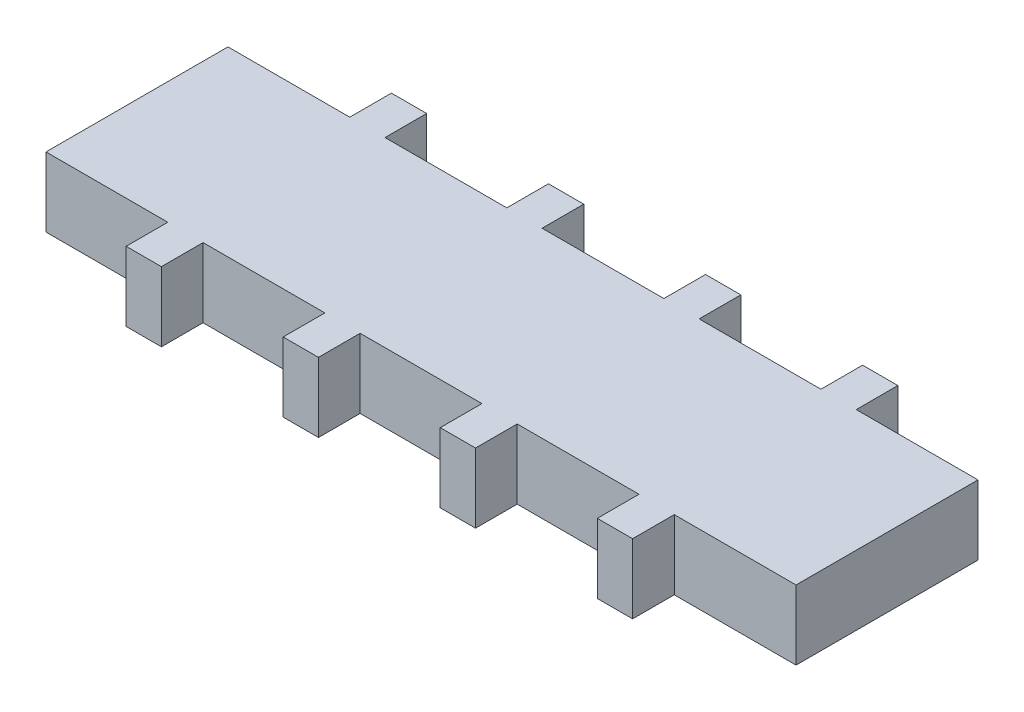
ISO-10303-21;
HEADER;
FILE_DESCRIPTION(('STEP AP214'),'2;1');
FILE_NAME('part.step','',(''),(''),'','','');
FILE_SCHEMA(('AUTOMOTIVE_DESIGN { 1 0 10303 214 1 1 1 1 }'));
ENDSEC;
DATA;
#1=APPLICATION_CONTEXT('core data for automotive mechanical design processes');
#2=APPLICATION_PROTOCOL_DEFINITION('international standard','automotive_design',2000,#1);
#3=PRODUCT_CONTEXT('',#1,'mechanical');
#4=PRODUCT('Part','Part','',(#3));
#5=PRODUCT_RELATED_PRODUCT_CATEGORY('part','',(#4));
#6=PRODUCT_DEFINITION_FORMATION('','',#4);
#7=PRODUCT_DEFINITION_CONTEXT('part definition',#1,'design');
#8=PRODUCT_DEFINITION('design','',#6,#7);
#9=PRODUCT_DEFINITION_SHAPE('','',#8);
#10=(LENGTH_UNIT() NAMED_UNIT(*) SI_UNIT(.MILLI.,.METRE.));
#11=(NAMED_UNIT(*) PLANE_ANGLE_UNIT() SI_UNIT($,.RADIAN.));
#12=(NAMED_UNIT(*) SI_UNIT($,.STERADIAN.) SOLID_ANGLE_UNIT());
#13=UNCERTAINTY_MEASURE_WITH_UNIT(LENGTH_MEASURE(1.E-05),#10,'distance_accuracy_value','');
#14=(GEOMETRIC_REPRESENTATION_CONTEXT(3) GLOBAL_UNCERTAINTY_ASSIGNED_CONTEXT((#13)) GLOBAL_UNIT_ASSIGNED_CONTEXT((#10,
#11,#12)) REPRESENTATION_CONTEXT('',''));
#15=CARTESIAN_POINT('',(0.,0.,0.));
#16=DIRECTION('',(0.,0.,1.));
#17=DIRECTION('',(1.,0.,0.));
#18=AXIS2_PLACEMENT_3D('',#15,#16,#17);
#19=CARTESIAN_POINT('',(27.,5.,0.));
#20=DIRECTION('',(1.,0.,0.));
#21=DIRECTION('',(0.,0.,-1.));
#22=AXIS2_PLACEMENT_3D('',#19,#20,#21);
#23=PLANE('',#22);
#24=DIRECTION('',(0.,0.,1.));
#25=VECTOR('',#24,1.);
#26=CARTESIAN_POINT('',(27.,0.,0.));
#27=LINE('',#26,#25);
#28=CARTESIAN_POINT('',(27.,0.,-6.55));
#29=VERTEX_POINT('',#28);
#30=CARTESIAN_POINT('',(27.,0.,6.55));
#31=VERTEX_POINT('',#30);
#32=EDGE_CURVE('E302',#29,#31,#27,.T.);
#33=ORIENTED_EDGE('',*,*,#32,.F.);
#34=DIRECTION('',(0.,-1.,0.));
#35=VECTOR('',#34,1.);
#36=CARTESIAN_POINT('',(27.,5.,-6.55));
#37=LINE('',#36,#35);
#38=CARTESIAN_POINT('',(27.,5.,-6.55));
#39=VERTEX_POINT('',#38);
#40=EDGE_CURVE('E11',#39,#29,#37,.T.);
#41=ORIENTED_EDGE('',*,*,#40,.F.);
#42=DIRECTION('',(0.,0.,1.));
#43=VECTOR('',#42,1.);
#44=CARTESIAN_POINT('',(27.,5.,0.));
#45=LINE('',#44,#43);
#46=CARTESIAN_POINT('',(27.,5.,6.55));
#47=VERTEX_POINT('',#46);
#48=EDGE_CURVE('E470',#39,#47,#45,.T.);
#49=ORIENTED_EDGE('',*,*,#48,.T.);
#50=DIRECTION('',(0.,-1.,0.));
#51=VECTOR('',#50,1.);
#52=CARTESIAN_POINT('',(27.,5.,6.55));
#53=LINE('',#52,#51);
#54=EDGE_CURVE('E173',#47,#31,#53,.T.);
#55=ORIENTED_EDGE('',*,*,#54,.T.);
#56=EDGE_LOOP('',(#33,#41,#49,#55));
#57=FACE_BOUND('',#56,.T.);
#58=ADVANCED_FACE('F39',(#57),#23,.T.);
#59=CARTESIAN_POINT('',(0.,5.,-6.55));
#60=DIRECTION('',(0.,0.,-1.));
#61=DIRECTION('',(-1.,0.,0.));
#62=AXIS2_PLACEMENT_3D('',#59,#60,#61);
#63=PLANE('',#62);
#64=DIRECTION('',(1.,0.,0.));
#65=VECTOR('',#64,1.);
#66=CARTESIAN_POINT('',(0.,0.,-6.55));
#67=LINE('',#66,#65);
#68=CARTESIAN_POINT('',(18.232,0.,-6.55));
#69=VERTEX_POINT('',#68);
#70=EDGE_CURVE('E305',#69,#29,#67,.T.);
#71=ORIENTED_EDGE('',*,*,#70,.F.);
#72=DIRECTION('',(0.,-1.,0.));
#73=VECTOR('',#72,1.);
#74=CARTESIAN_POINT('',(18.232,5.,-6.55));
#75=LINE('',#74,#73);
#76=CARTESIAN_POINT('',(18.232,5.,-6.55));
#77=VERTEX_POINT('',#76);
#78=EDGE_CURVE('E47',#77,#69,#75,.T.);
#79=ORIENTED_EDGE('',*,*,#78,.F.);
#80=DIRECTION('',(1.,0.,0.));
#81=VECTOR('',#80,1.);
#82=CARTESIAN_POINT('',(0.,5.,-6.55));
#83=LINE('',#82,#81);
#84=EDGE_CURVE('E469',#77,#39,#83,.T.);
#85=ORIENTED_EDGE('',*,*,#84,.T.);
#86=ORIENTED_EDGE('',*,*,#40,.T.);
#87=EDGE_LOOP('',(#71,#79,#85,#86));
#88=FACE_BOUND('',#87,.T.);
#89=ADVANCED_FACE('F468',(#88),#63,.T.);
#90=CARTESIAN_POINT('',(18.232,5.,0.));
#91=DIRECTION('',(-1.,0.,0.));
#92=DIRECTION('',(0.,0.,1.));
#93=AXIS2_PLACEMENT_3D('',#90,#91,#92);
#94=PLANE('',#93);
#95=DIRECTION('',(0.,0.,-1.));
#96=VECTOR('',#95,1.);
#97=CARTESIAN_POINT('',(18.232,0.,0.));
#98=LINE('',#97,#96);
#99=CARTESIAN_POINT('',(18.232,0.,-9.55));
#100=VERTEX_POINT('',#99);
#101=EDGE_CURVE('E308',#69,#100,#98,.T.);
#102=ORIENTED_EDGE('',*,*,#101,.T.);
#103=DIRECTION('',(0.,-1.,0.));
#104=VECTOR('',#103,1.);
#105=CARTESIAN_POINT('',(18.232,5.,-9.55));
#106=LINE('',#105,#104);
#107=CARTESIAN_POINT('',(18.232,5.,-9.55));
#108=VERTEX_POINT('',#107);
#109=EDGE_CURVE('E454',#108,#100,#106,.T.);
#110=ORIENTED_EDGE('',*,*,#109,.F.);
#111=DIRECTION('',(0.,0.,-1.));
#112=VECTOR('',#111,1.);
#113=CARTESIAN_POINT('',(18.232,5.,0.));
#114=LINE('',#113,#112);
#115=EDGE_CURVE('E460',#77,#108,#114,.T.);
#116=ORIENTED_EDGE('',*,*,#115,.F.);
#117=ORIENTED_EDGE('',*,*,#78,.T.);
#118=EDGE_LOOP('',(#102,#110,#116,#117));
#119=FACE_BOUND('',#118,.T.);
#120=ADVANCED_FACE('F458',(#119),#94,.F.);
#121=CARTESIAN_POINT('',(0.,5.,-9.55));
#122=DIRECTION('',(0.,0.,-1.));
#123=DIRECTION('',(-1.,0.,0.));
#124=AXIS2_PLACEMENT_3D('',#121,#122,#123);
#125=PLANE('',#124);
#126=DIRECTION('',(1.,0.,0.));
#127=VECTOR('',#126,1.);
#128=CARTESIAN_POINT('',(0.,0.,-9.55));
#129=LINE('',#128,#127);
#130=CARTESIAN_POINT('',(15.692,0.,-9.55));
#131=VERTEX_POINT('',#130);
#132=EDGE_CURVE('E313',#131,#100,#129,.T.);
#133=ORIENTED_EDGE('',*,*,#132,.F.);
#134=DIRECTION('',(0.,-1.,0.));
#135=VECTOR('',#134,1.);
#136=CARTESIAN_POINT('',(15.692,5.,-9.55));
#137=LINE('',#136,#135);
#138=CARTESIAN_POINT('',(15.692,5.,-9.55));
#139=VERTEX_POINT('',#138);
#140=EDGE_CURVE('E452',#139,#131,#137,.T.);
#141=ORIENTED_EDGE('',*,*,#140,.F.);
#142=DIRECTION('',(1.,0.,0.));
#143=VECTOR('',#142,1.);
#144=CARTESIAN_POINT('',(0.,5.,-9.55));
#145=LINE('',#144,#143);
#146=EDGE_CURVE('E562',#139,#108,#145,.T.);
#147=ORIENTED_EDGE('',*,*,#146,.T.);
#148=ORIENTED_EDGE('',*,*,#109,.T.);
#149=EDGE_LOOP('',(#133,#141,#147,#148));
#150=FACE_BOUND('',#149,.T.);
#151=ADVANCED_FACE('F622',(#150),#125,.T.);
#152=CARTESIAN_POINT('',(15.692,5.,0.));
#153=DIRECTION('',(-1.,0.,0.));
#154=DIRECTION('',(0.,0.,1.));
#155=AXIS2_PLACEMENT_3D('',#152,#153,#154);
#156=PLANE('',#155);
#157=DIRECTION('',(0.,0.,-1.));
#158=VECTOR('',#157,1.);
#159=CARTESIAN_POINT('',(15.692,0.,0.));
#160=LINE('',#159,#158);
#161=CARTESIAN_POINT('',(15.692,0.,-6.55));
#162=VERTEX_POINT('',#161);
#163=EDGE_CURVE('E316',#162,#131,#160,.T.);
#164=ORIENTED_EDGE('',*,*,#163,.F.);
#165=DIRECTION('',(0.,-1.,0.));
#166=VECTOR('',#165,1.);
#167=CARTESIAN_POINT('',(15.692,5.,-6.55));
#168=LINE('',#167,#166);
#169=CARTESIAN_POINT('',(15.692,5.,-6.55));
#170=VERTEX_POINT('',#169);
#171=EDGE_CURVE('E450',#170,#162,#168,.T.);
#172=ORIENTED_EDGE('',*,*,#171,.F.);
#173=DIRECTION('',(0.,0.,-1.));
#174=VECTOR('',#173,1.);
#175=CARTESIAN_POINT('',(15.692,5.,0.));
#176=LINE('',#175,#174);
#177=EDGE_CURVE('E559',#170,#139,#176,.T.);
#178=ORIENTED_EDGE('',*,*,#177,.T.);
#179=ORIENTED_EDGE('',*,*,#140,.T.);
#180=EDGE_LOOP('',(#164,#172,#178,#179));
#181=FACE_BOUND('',#180,.T.);
#182=ADVANCED_FACE('F627',(#181),#156,.T.);
#183=CARTESIAN_POINT('',(6.924,0.,-6.55));
#184=VERTEX_POINT('',#183);
#185=EDGE_CURVE('E310',#184,#162,#67,.T.);
#186=ORIENTED_EDGE('',*,*,#185,.F.);
#187=DIRECTION('',(0.,-1.,0.));
#188=VECTOR('',#187,1.);
#189=CARTESIAN_POINT('',(6.924,5.,-6.55));
#190=LINE('',#189,#188);
#191=CARTESIAN_POINT('',(6.924,5.,-6.55));
#192=VERTEX_POINT('',#191);
#193=EDGE_CURVE('E448',#192,#184,#190,.T.);
#194=ORIENTED_EDGE('',*,*,#193,.F.);
#195=EDGE_CURVE('E558',#192,#170,#83,.T.);
#196=ORIENTED_EDGE('',*,*,#195,.T.);
#197=ORIENTED_EDGE('',*,*,#171,.T.);
#198=EDGE_LOOP('',(#186,#194,#196,#197));
#199=FACE_BOUND('',#198,.T.);
#200=ADVANCED_FACE('F618',(#199),#63,.T.);
#201=CARTESIAN_POINT('',(6.924,5.,0.));
#202=DIRECTION('',(-1.,0.,0.));
#203=DIRECTION('',(0.,0.,1.));
#204=AXIS2_PLACEMENT_3D('',#201,#202,#203);
#205=PLANE('',#204);
#206=DIRECTION('',(0.,0.,-1.));
#207=VECTOR('',#206,1.);
#208=CARTESIAN_POINT('',(6.924,0.,0.));
#209=LINE('',#208,#207);
#210=CARTESIAN_POINT('',(6.924,0.,-9.55));
#211=VERTEX_POINT('',#210);
#212=EDGE_CURVE('E319',#184,#211,#209,.T.);
#213=ORIENTED_EDGE('',*,*,#212,.T.);
#214=DIRECTION('',(0.,-1.,0.));
#215=VECTOR('',#214,1.);
#216=CARTESIAN_POINT('',(6.924,5.,-9.55));
#217=LINE('',#216,#215);
#218=CARTESIAN_POINT('',(6.924,5.,-9.55));
#219=VERTEX_POINT('',#218);
#220=EDGE_CURVE('E446',#219,#211,#217,.T.);
#221=ORIENTED_EDGE('',*,*,#220,.F.);
#222=DIRECTION('',(0.,0.,-1.));
#223=VECTOR('',#222,1.);
#224=CARTESIAN_POINT('',(6.924,5.,0.));
#225=LINE('',#224,#223);
#226=EDGE_CURVE('E556',#192,#219,#225,.T.);
#227=ORIENTED_EDGE('',*,*,#226,.F.);
#228=ORIENTED_EDGE('',*,*,#193,.T.);
#229=EDGE_LOOP('',(#213,#221,#227,#228));
#230=FACE_BOUND('',#229,.T.);
#231=ADVANCED_FACE('F626',(#230),#205,.F.);
#232=CARTESIAN_POINT('',(0.,5.,-9.55));
#233=DIRECTION('',(0.,0.,-1.));
#234=DIRECTION('',(-1.,0.,0.));
#235=AXIS2_PLACEMENT_3D('',#232,#233,#234);
#236=PLANE('',#235);
#237=DIRECTION('',(1.,0.,0.));
#238=VECTOR('',#237,1.);
#239=CARTESIAN_POINT('',(0.,0.,-9.55));
#240=LINE('',#239,#238);
#241=CARTESIAN_POINT('',(4.384,0.,-9.55));
#242=VERTEX_POINT('',#241);
#243=EDGE_CURVE('E322',#242,#211,#240,.T.);
#244=ORIENTED_EDGE('',*,*,#243,.F.);
#245=DIRECTION('',(0.,-1.,0.));
#246=VECTOR('',#245,1.);
#247=CARTESIAN_POINT('',(4.384,5.,-9.55));
#248=LINE('',#247,#246);
#249=CARTESIAN_POINT('',(4.384,5.,-9.55));
#250=VERTEX_POINT('',#249);
#251=EDGE_CURVE('E444',#250,#242,#248,.T.);
#252=ORIENTED_EDGE('',*,*,#251,.F.);
#253=DIRECTION('',(1.,0.,0.));
#254=VECTOR('',#253,1.);
#255=CARTESIAN_POINT('',(0.,5.,-9.55));
#256=LINE('',#255,#254);
#257=EDGE_CURVE('E553',#250,#219,#256,.T.);
#258=ORIENTED_EDGE('',*,*,#257,.T.);
#259=ORIENTED_EDGE('',*,*,#220,.T.);
#260=EDGE_LOOP('',(#244,#252,#258,#259));
#261=FACE_BOUND('',#260,.T.);
#262=ADVANCED_FACE('F699',(#261),#236,.T.);
#263=CARTESIAN_POINT('',(4.384,5.,0.));
#264=DIRECTION('',(-1.,0.,0.));
#265=DIRECTION('',(0.,0.,1.));
#266=AXIS2_PLACEMENT_3D('',#263,#264,#265);
#267=PLANE('',#266);
#268=DIRECTION('',(0.,0.,-1.));
#269=VECTOR('',#268,1.);
#270=CARTESIAN_POINT('',(4.384,0.,0.));
#271=LINE('',#270,#269);
#272=CARTESIAN_POINT('',(4.384,0.,-6.55));
#273=VERTEX_POINT('',#272);
#274=EDGE_CURVE('E325',#273,#242,#271,.T.);
#275=ORIENTED_EDGE('',*,*,#274,.F.);
#276=DIRECTION('',(0.,-1.,0.));
#277=VECTOR('',#276,1.);
#278=CARTESIAN_POINT('',(4.384,5.,-6.55));
#279=LINE('',#278,#277);
#280=CARTESIAN_POINT('',(4.384,5.,-6.55));
#281=VERTEX_POINT('',#280);
#282=EDGE_CURVE('E442',#281,#273,#279,.T.);
#283=ORIENTED_EDGE('',*,*,#282,.F.);
#284=DIRECTION('',(0.,0.,-1.));
#285=VECTOR('',#284,1.);
#286=CARTESIAN_POINT('',(4.384,5.,0.));
#287=LINE('',#286,#285);
#288=EDGE_CURVE('E550',#281,#250,#287,.T.);
#289=ORIENTED_EDGE('',*,*,#288,.T.);
#290=ORIENTED_EDGE('',*,*,#251,.T.);
#291=EDGE_LOOP('',(#275,#283,#289,#290));
#292=FACE_BOUND('',#291,.T.);
#293=ADVANCED_FACE('F690',(#292),#267,.T.);
#294=CARTESIAN_POINT('',(-4.384,0.,-6.55));
#295=VERTEX_POINT('',#294);
#296=EDGE_CURVE('E328',#295,#273,#67,.T.);
#297=ORIENTED_EDGE('',*,*,#296,.F.);
#298=DIRECTION('',(0.,-1.,0.));
#299=VECTOR('',#298,1.);
#300=CARTESIAN_POINT('',(-4.384,5.,-6.55));
#301=LINE('',#300,#299);
#302=CARTESIAN_POINT('',(-4.384,5.,-6.55));
#303=VERTEX_POINT('',#302);
#304=EDGE_CURVE('E440',#303,#295,#301,.T.);
#305=ORIENTED_EDGE('',*,*,#304,.F.);
#306=EDGE_CURVE('E549',#303,#281,#83,.T.);
#307=ORIENTED_EDGE('',*,*,#306,.T.);
#308=ORIENTED_EDGE('',*,*,#282,.T.);
#309=EDGE_LOOP('',(#297,#305,#307,#308));
#310=FACE_BOUND('',#309,.T.);
#311=ADVANCED_FACE('F612',(#310),#63,.T.);
#312=CARTESIAN_POINT('',(-4.384,5.,0.));
#313=DIRECTION('',(-1.,0.,0.));
#314=DIRECTION('',(0.,0.,1.));
#315=AXIS2_PLACEMENT_3D('',#312,#313,#314);
#316=PLANE('',#315);
#317=DIRECTION('',(0.,0.,-1.));
#318=VECTOR('',#317,1.);
#319=CARTESIAN_POINT('',(-4.384,0.,0.));
#320=LINE('',#319,#318);
#321=CARTESIAN_POINT('',(-4.384,0.,-9.55));
#322=VERTEX_POINT('',#321);
#323=EDGE_CURVE('E329',#295,#322,#320,.T.);
#324=ORIENTED_EDGE('',*,*,#323,.T.);
#325=DIRECTION('',(0.,-1.,0.));
#326=VECTOR('',#325,1.);
#327=CARTESIAN_POINT('',(-4.384,5.,-9.55));
#328=LINE('',#327,#326);
#329=CARTESIAN_POINT('',(-4.384,5.,-9.55));
#330=VERTEX_POINT('',#329);
#331=EDGE_CURVE('E437',#330,#322,#328,.T.);
#332=ORIENTED_EDGE('',*,*,#331,.F.);
#333=DIRECTION('',(0.,0.,-1.));
#334=VECTOR('',#333,1.);
#335=CARTESIAN_POINT('',(-4.384,5.,0.));
#336=LINE('',#335,#334);
#337=EDGE_CURVE('E547',#303,#330,#336,.T.);
#338=ORIENTED_EDGE('',*,*,#337,.F.);
#339=ORIENTED_EDGE('',*,*,#304,.T.);
#340=EDGE_LOOP('',(#324,#332,#338,#339));
#341=FACE_BOUND('',#340,.T.);
#342=ADVANCED_FACE('F671',(#341),#316,.F.);
#343=CARTESIAN_POINT('',(0.,5.,-9.55));
#344=DIRECTION('',(0.,0.,1.));
#345=DIRECTION('',(1.,0.,0.));
#346=AXIS2_PLACEMENT_3D('',#343,#344,#345);
#347=PLANE('',#346);
#348=DIRECTION('',(-1.,0.,0.));
#349=VECTOR('',#348,1.);
#350=CARTESIAN_POINT('',(0.,0.,-9.55));
#351=LINE('',#350,#349);
#352=CARTESIAN_POINT('',(-6.924,0.,-9.55));
#353=VERTEX_POINT('',#352);
#354=EDGE_CURVE('E331',#322,#353,#351,.T.);
#355=ORIENTED_EDGE('',*,*,#354,.T.);
#356=DIRECTION('',(0.,-1.,0.));
#357=VECTOR('',#356,1.);
#358=CARTESIAN_POINT('',(-6.924,5.,-9.55));
#359=LINE('',#358,#357);
#360=CARTESIAN_POINT('',(-6.924,5.,-9.55));
#361=VERTEX_POINT('',#360);
#362=EDGE_CURVE('E435',#361,#353,#359,.T.);
#363=ORIENTED_EDGE('',*,*,#362,.F.);
#364=DIRECTION('',(-1.,0.,0.));
#365=VECTOR('',#364,1.);
#366=CARTESIAN_POINT('',(0.,5.,-9.55));
#367=LINE('',#366,#365);
#368=EDGE_CURVE('E545',#330,#361,#367,.T.);
#369=ORIENTED_EDGE('',*,*,#368,.F.);
#370=ORIENTED_EDGE('',*,*,#331,.T.);
#371=EDGE_LOOP('',(#355,#363,#369,#370));
#372=FACE_BOUND('',#371,.T.);
#373=ADVANCED_FACE('F662',(#372),#347,.F.);
#374=CARTESIAN_POINT('',(-6.924,5.,0.));
#375=DIRECTION('',(-1.,0.,0.));
#376=DIRECTION('',(0.,0.,1.));
#377=AXIS2_PLACEMENT_3D('',#374,#375,#376);
#378=PLANE('',#377);
#379=DIRECTION('',(0.,0.,-1.));
#380=VECTOR('',#379,1.);
#381=CARTESIAN_POINT('',(-6.924,0.,0.));
#382=LINE('',#381,#380);
#383=CARTESIAN_POINT('',(-6.924,0.,-6.55));
#384=VERTEX_POINT('',#383);
#385=EDGE_CURVE('E334',#384,#353,#382,.T.);
#386=ORIENTED_EDGE('',*,*,#385,.F.);
#387=DIRECTION('',(0.,-1.,0.));
#388=VECTOR('',#387,1.);
#389=CARTESIAN_POINT('',(-6.924,5.,-6.55));
#390=LINE('',#389,#388);
#391=CARTESIAN_POINT('',(-6.924,5.,-6.55));
#392=VERTEX_POINT('',#391);
#393=EDGE_CURVE('E433',#392,#384,#390,.T.);
#394=ORIENTED_EDGE('',*,*,#393,.F.);
#395=DIRECTION('',(0.,0.,-1.));
#396=VECTOR('',#395,1.);
#397=CARTESIAN_POINT('',(-6.924,5.,0.));
#398=LINE('',#397,#396);
#399=EDGE_CURVE('E542',#392,#361,#398,.T.);
#400=ORIENTED_EDGE('',*,*,#399,.T.);
#401=ORIENTED_EDGE('',*,*,#362,.T.);
#402=EDGE_LOOP('',(#386,#394,#400,#401));
#403=FACE_BOUND('',#402,.T.);
#404=ADVANCED_FACE('F584',(#403),#378,.T.);
#405=CARTESIAN_POINT('',(-15.692,0.,-6.55));
#406=VERTEX_POINT('',#405);
#407=EDGE_CURVE('E337',#406,#384,#67,.T.);
#408=ORIENTED_EDGE('',*,*,#407,.F.);
#409=DIRECTION('',(0.,-1.,0.));
#410=VECTOR('',#409,1.);
#411=CARTESIAN_POINT('',(-15.692,5.,-6.55));
#412=LINE('',#411,#410);
#413=CARTESIAN_POINT('',(-15.692,5.,-6.55));
#414=VERTEX_POINT('',#413);
#415=EDGE_CURVE('E431',#414,#406,#412,.T.);
#416=ORIENTED_EDGE('',*,*,#415,.F.);
#417=EDGE_CURVE('E533',#414,#392,#83,.T.);
#418=ORIENTED_EDGE('',*,*,#417,.T.);
#419=ORIENTED_EDGE('',*,*,#393,.T.);
#420=EDGE_LOOP('',(#408,#416,#418,#419));
#421=FACE_BOUND('',#420,.T.);
#422=ADVANCED_FACE('F575',(#421),#63,.T.);
#423=CARTESIAN_POINT('',(-15.692,5.,0.));
#424=DIRECTION('',(-1.,0.,0.));
#425=DIRECTION('',(0.,0.,1.));
#426=AXIS2_PLACEMENT_3D('',#423,#424,#425);
#427=PLANE('',#426);
#428=DIRECTION('',(0.,0.,-1.));
#429=VECTOR('',#428,1.);
#430=CARTESIAN_POINT('',(-15.692,0.,0.));
#431=LINE('',#430,#429);
#432=CARTESIAN_POINT('',(-15.692,0.,-9.55));
#433=VERTEX_POINT('',#432);
#434=EDGE_CURVE('E338',#406,#433,#431,.T.);
#435=ORIENTED_EDGE('',*,*,#434,.T.);
#436=DIRECTION('',(0.,-1.,0.));
#437=VECTOR('',#436,1.);
#438=CARTESIAN_POINT('',(-15.692,5.,-9.55));
#439=LINE('',#438,#437);
#440=CARTESIAN_POINT('',(-15.692,5.,-9.55));
#441=VERTEX_POINT('',#440);
#442=EDGE_CURVE('E429',#441,#433,#439,.T.);
#443=ORIENTED_EDGE('',*,*,#442,.F.);
#444=DIRECTION('',(0.,0.,-1.));
#445=VECTOR('',#444,1.);
#446=CARTESIAN_POINT('',(-15.692,5.,0.));
#447=LINE('',#446,#445);
#448=EDGE_CURVE('E540',#414,#441,#447,.T.);
#449=ORIENTED_EDGE('',*,*,#448,.F.);
#450=ORIENTED_EDGE('',*,*,#415,.T.);
#451=EDGE_LOOP('',(#435,#443,#449,#450));
#452=FACE_BOUND('',#451,.T.);
#453=ADVANCED_FACE('F603',(#452),#427,.F.);
#454=CARTESIAN_POINT('',(0.,5.,-9.55000000000003));
#455=DIRECTION('',(0.,0.,-1.));
#456=DIRECTION('',(-1.,0.,0.));
#457=AXIS2_PLACEMENT_3D('',#454,#455,#456);
#458=PLANE('',#457);
#459=DIRECTION('',(1.,0.,0.));
#460=VECTOR('',#459,1.);
#461=CARTESIAN_POINT('',(0.,0.,-9.55000000000003));
#462=LINE('',#461,#460);
#463=CARTESIAN_POINT('',(-18.232,0.,-9.55));
#464=VERTEX_POINT('',#463);
#465=EDGE_CURVE('E341',#464,#433,#462,.T.);
#466=ORIENTED_EDGE('',*,*,#465,.F.);
#467=DIRECTION('',(0.,-1.,0.));
#468=VECTOR('',#467,1.);
#469=CARTESIAN_POINT('',(-18.232,5.,-9.55));
#470=LINE('',#469,#468);
#471=CARTESIAN_POINT('',(-18.232,5.,-9.55));
#472=VERTEX_POINT('',#471);
#473=EDGE_CURVE('E427',#472,#464,#470,.T.);
#474=ORIENTED_EDGE('',*,*,#473,.F.);
#475=DIRECTION('',(1.,0.,0.));
#476=VECTOR('',#475,1.);
#477=CARTESIAN_POINT('',(0.,5.,-9.55000000000003));
#478=LINE('',#477,#476);
#479=EDGE_CURVE('E537',#472,#441,#478,.T.);
#480=ORIENTED_EDGE('',*,*,#479,.T.);
#481=ORIENTED_EDGE('',*,*,#442,.T.);
#482=EDGE_LOOP('',(#466,#474,#480,#481));
#483=FACE_BOUND('',#482,.T.);
#484=ADVANCED_FACE('F601',(#483),#458,.T.);
#485=CARTESIAN_POINT('',(-18.232,5.,0.));
#486=DIRECTION('',(-1.,0.,0.));
#487=DIRECTION('',(0.,0.,1.));
#488=AXIS2_PLACEMENT_3D('',#485,#486,#487);
#489=PLANE('',#488);
#490=DIRECTION('',(0.,0.,-1.));
#491=VECTOR('',#490,1.);
#492=CARTESIAN_POINT('',(-18.232,0.,0.));
#493=LINE('',#492,#491);
#494=CARTESIAN_POINT('',(-18.232,0.,-6.55));
#495=VERTEX_POINT('',#494);
#496=EDGE_CURVE('E344',#495,#464,#493,.T.);
#497=ORIENTED_EDGE('',*,*,#496,.F.);
#498=DIRECTION('',(0.,-1.,0.));
#499=VECTOR('',#498,1.);
#500=CARTESIAN_POINT('',(-18.232,5.,-6.55));
#501=LINE('',#500,#499);
#502=CARTESIAN_POINT('',(-18.232,5.,-6.55));
#503=VERTEX_POINT('',#502);
#504=EDGE_CURVE('E425',#503,#495,#501,.T.);
#505=ORIENTED_EDGE('',*,*,#504,.F.);
#506=DIRECTION('',(0.,0.,-1.));
#507=VECTOR('',#506,1.);
#508=CARTESIAN_POINT('',(-18.232,5.,0.));
#509=LINE('',#508,#507);
#510=EDGE_CURVE('E531',#503,#472,#509,.T.);
#511=ORIENTED_EDGE('',*,*,#510,.T.);
#512=ORIENTED_EDGE('',*,*,#473,.T.);
#513=EDGE_LOOP('',(#497,#505,#511,#512));
#514=FACE_BOUND('',#513,.T.);
#515=ADVANCED_FACE('F598',(#514),#489,.T.);
#516=CARTESIAN_POINT('',(-27.,0.,-6.55));
#517=VERTEX_POINT('',#516);
#518=EDGE_CURVE('E309',#517,#495,#67,.T.);
#519=ORIENTED_EDGE('',*,*,#518,.F.);
#520=DIRECTION('',(0.,-1.,0.));
#521=VECTOR('',#520,1.);
#522=CARTESIAN_POINT('',(-27.,5.,-6.55));
#523=LINE('',#522,#521);
#524=CARTESIAN_POINT('',(-27.,5.,-6.55));
#525=VERTEX_POINT('',#524);
#526=EDGE_CURVE('E423',#525,#517,#523,.T.);
#527=ORIENTED_EDGE('',*,*,#526,.F.);
#528=EDGE_CURVE('E526',#525,#503,#83,.T.);
#529=ORIENTED_EDGE('',*,*,#528,.T.);
#530=ORIENTED_EDGE('',*,*,#504,.T.);
#531=EDGE_LOOP('',(#519,#527,#529,#530));
#532=FACE_BOUND('',#531,.T.);
#533=ADVANCED_FACE('F595',(#532),#63,.T.);
#534=CARTESIAN_POINT('',(-27.,5.,0.));
#535=DIRECTION('',(1.,0.,0.));
#536=DIRECTION('',(0.,0.,-1.));
#537=AXIS2_PLACEMENT_3D('',#534,#535,#536);
#538=PLANE('',#537);
#539=DIRECTION('',(0.,0.,1.));
#540=VECTOR('',#539,1.);
#541=CARTESIAN_POINT('',(-27.,0.,0.));
#542=LINE('',#541,#540);
#543=CARTESIAN_POINT('',(-27.,0.,6.55));
#544=VERTEX_POINT('',#543);
#545=EDGE_CURVE('E347',#517,#544,#542,.T.);
#546=ORIENTED_EDGE('',*,*,#545,.T.);
#547=DIRECTION('',(0.,-1.,0.));
#548=VECTOR('',#547,1.);
#549=CARTESIAN_POINT('',(-27.,5.,6.55));
#550=LINE('',#549,#548);
#551=CARTESIAN_POINT('',(-27.,5.,6.55));
#552=VERTEX_POINT('',#551);
#553=EDGE_CURVE('E420',#552,#544,#550,.T.);
#554=ORIENTED_EDGE('',*,*,#553,.F.);
#555=DIRECTION('',(0.,0.,1.));
#556=VECTOR('',#555,1.);
#557=CARTESIAN_POINT('',(-27.,5.,0.));
#558=LINE('',#557,#556);
#559=EDGE_CURVE('E523',#525,#552,#558,.T.);
#560=ORIENTED_EDGE('',*,*,#559,.F.);
#561=ORIENTED_EDGE('',*,*,#526,.T.);
#562=EDGE_LOOP('',(#546,#554,#560,#561));
#563=FACE_BOUND('',#562,.T.);
#564=ADVANCED_FACE('F629',(#563),#538,.F.);
#565=CARTESIAN_POINT('',(0.,5.,6.55));
#566=DIRECTION('',(0.,0.,-1.));
#567=DIRECTION('',(-1.,0.,0.));
#568=AXIS2_PLACEMENT_3D('',#565,#566,#567);
#569=PLANE('',#568);
#570=DIRECTION('',(1.,0.,0.));
#571=VECTOR('',#570,1.);
#572=CARTESIAN_POINT('',(0.,0.,6.55));
#573=LINE('',#572,#571);
#574=CARTESIAN_POINT('',(-18.232,0.,6.55));
#575=VERTEX_POINT('',#574);
#576=EDGE_CURVE('E349',#544,#575,#573,.T.);
#577=ORIENTED_EDGE('',*,*,#576,.T.);
#578=DIRECTION('',(0.,-1.,0.));
#579=VECTOR('',#578,1.);
#580=CARTESIAN_POINT('',(-18.232,5.,6.55));
#581=LINE('',#580,#579);
#582=CARTESIAN_POINT('',(-18.232,5.,6.55));
#583=VERTEX_POINT('',#582);
#584=EDGE_CURVE('E417',#583,#575,#581,.T.);
#585=ORIENTED_EDGE('',*,*,#584,.F.);
#586=DIRECTION('',(1.,0.,0.));
#587=VECTOR('',#586,1.);
#588=CARTESIAN_POINT('',(0.,5.,6.55));
#589=LINE('',#588,#587);
#590=EDGE_CURVE('E299',#552,#583,#589,.T.);
#591=ORIENTED_EDGE('',*,*,#590,.F.);
#592=ORIENTED_EDGE('',*,*,#553,.T.);
#593=EDGE_LOOP('',(#577,#585,#591,#592));
#594=FACE_BOUND('',#593,.T.);
#595=ADVANCED_FACE('F634',(#594),#569,.F.);
#596=CARTESIAN_POINT('',(-18.232,5.,0.));
#597=DIRECTION('',(1.,0.,0.));
#598=DIRECTION('',(0.,0.,-1.));
#599=AXIS2_PLACEMENT_3D('',#596,#597,#598);
#600=PLANE('',#599);
#601=DIRECTION('',(0.,0.,1.));
#602=VECTOR('',#601,1.);
#603=CARTESIAN_POINT('',(-18.232,0.,0.));
#604=LINE('',#603,#602);
#605=CARTESIAN_POINT('',(-18.232,0.,9.55));
#606=VERTEX_POINT('',#605);
#607=EDGE_CURVE('E351',#575,#606,#604,.T.);
#608=ORIENTED_EDGE('',*,*,#607,.T.);
#609=DIRECTION('',(0.,-1.,0.));
#610=VECTOR('',#609,1.);
#611=CARTESIAN_POINT('',(-18.232,5.,9.55));
#612=LINE('',#611,#610);
#613=CARTESIAN_POINT('',(-18.232,5.,9.55));
#614=VERTEX_POINT('',#613);
#615=EDGE_CURVE('E414',#614,#606,#612,.T.);
#616=ORIENTED_EDGE('',*,*,#615,.F.);
#617=DIRECTION('',(0.,0.,1.));
#618=VECTOR('',#617,1.);
#619=CARTESIAN_POINT('',(-18.232,5.,0.));
#620=LINE('',#619,#618);
#621=EDGE_CURVE('E522',#583,#614,#620,.T.);
#622=ORIENTED_EDGE('',*,*,#621,.F.);
#623=ORIENTED_EDGE('',*,*,#584,.T.);
#624=EDGE_LOOP('',(#608,#616,#622,#623));
#625=FACE_BOUND('',#624,.T.);
#626=ADVANCED_FACE('F850',(#625),#600,.F.);
#627=CARTESIAN_POINT('',(0.,5.,9.55));
#628=DIRECTION('',(0.,0.,-1.));
#629=DIRECTION('',(-1.,0.,0.));
#630=AXIS2_PLACEMENT_3D('',#627,#628,#629);
#631=PLANE('',#630);
#632=DIRECTION('',(1.,0.,0.));
#633=VECTOR('',#632,1.);
#634=CARTESIAN_POINT('',(0.,0.,9.55));
#635=LINE('',#634,#633);
#636=CARTESIAN_POINT('',(-15.692,0.,9.55));
#637=VERTEX_POINT('',#636);
#638=EDGE_CURVE('E355',#606,#637,#635,.T.);
#639=ORIENTED_EDGE('',*,*,#638,.T.);
#640=DIRECTION('',(0.,-1.,0.));
#641=VECTOR('',#640,1.);
#642=CARTESIAN_POINT('',(-15.692,5.,9.55));
#643=LINE('',#642,#641);
#644=CARTESIAN_POINT('',(-15.692,5.,9.55));
#645=VERTEX_POINT('',#644);
#646=EDGE_CURVE('E412',#645,#637,#643,.T.);
#647=ORIENTED_EDGE('',*,*,#646,.F.);
#648=DIRECTION('',(1.,0.,0.));
#649=VECTOR('',#648,1.);
#650=CARTESIAN_POINT('',(0.,5.,9.55));
#651=LINE('',#650,#649);
#652=EDGE_CURVE('E521',#614,#645,#651,.T.);
#653=ORIENTED_EDGE('',*,*,#652,.F.);
#654=ORIENTED_EDGE('',*,*,#615,.T.);
#655=EDGE_LOOP('',(#639,#647,#653,#654));
#656=FACE_BOUND('',#655,.T.);
#657=ADVANCED_FACE('F872',(#656),#631,.F.);
#658=CARTESIAN_POINT('',(-15.692,5.,0.));
#659=DIRECTION('',(1.,0.,0.));
#660=DIRECTION('',(0.,0.,-1.));
#661=AXIS2_PLACEMENT_3D('',#658,#659,#660);
#662=PLANE('',#661);
#663=DIRECTION('',(0.,0.,1.));
#664=VECTOR('',#663,1.);
#665=CARTESIAN_POINT('',(-15.692,0.,0.));
#666=LINE('',#665,#664);
#667=CARTESIAN_POINT('',(-15.692,0.,6.55));
#668=VERTEX_POINT('',#667);
#669=EDGE_CURVE('E358',#668,#637,#666,.T.);
#670=ORIENTED_EDGE('',*,*,#669,.F.);
#671=DIRECTION('',(0.,-1.,0.));
#672=VECTOR('',#671,1.);
#673=CARTESIAN_POINT('',(-15.692,5.,6.55));
#674=LINE('',#673,#672);
#675=CARTESIAN_POINT('',(-15.692,5.,6.55));
#676=VERTEX_POINT('',#675);
#677=EDGE_CURVE('E410',#676,#668,#674,.T.);
#678=ORIENTED_EDGE('',*,*,#677,.F.);
#679=DIRECTION('',(0.,0.,1.));
#680=VECTOR('',#679,1.);
#681=CARTESIAN_POINT('',(-15.692,5.,0.));
#682=LINE('',#681,#680);
#683=EDGE_CURVE('E518',#676,#645,#682,.T.);
#684=ORIENTED_EDGE('',*,*,#683,.T.);
#685=ORIENTED_EDGE('',*,*,#646,.T.);
#686=EDGE_LOOP('',(#670,#678,#684,#685));
#687=FACE_BOUND('',#686,.T.);
#688=ADVANCED_FACE('F881',(#687),#662,.T.);
#689=CARTESIAN_POINT('',(-6.92400000000001,0.,6.55));
#690=VERTEX_POINT('',#689);
#691=EDGE_CURVE('E353',#668,#690,#573,.T.);
#692=ORIENTED_EDGE('',*,*,#691,.T.);
#693=DIRECTION('',(0.,-1.,0.));
#694=VECTOR('',#693,1.);
#695=CARTESIAN_POINT('',(-6.92400000000001,5.,6.55));
#696=LINE('',#695,#694);
#697=CARTESIAN_POINT('',(-6.92400000000001,5.,6.55));
#698=VERTEX_POINT('',#697);
#699=EDGE_CURVE('E407',#698,#690,#696,.T.);
#700=ORIENTED_EDGE('',*,*,#699,.F.);
#701=EDGE_CURVE('E503',#676,#698,#589,.T.);
#702=ORIENTED_EDGE('',*,*,#701,.F.);
#703=ORIENTED_EDGE('',*,*,#677,.T.);
#704=EDGE_LOOP('',(#692,#700,#702,#703));
#705=FACE_BOUND('',#704,.T.);
#706=ADVANCED_FACE('F481',(#705),#569,.F.);
#707=CARTESIAN_POINT('',(-6.92400000000001,5.,0.));
#708=DIRECTION('',(1.,0.,0.));
#709=DIRECTION('',(0.,0.,-1.));
#710=AXIS2_PLACEMENT_3D('',#707,#708,#709);
#711=PLANE('',#710);
#712=DIRECTION('',(0.,0.,1.));
#713=VECTOR('',#712,1.);
#714=CARTESIAN_POINT('',(-6.92400000000001,0.,0.));
#715=LINE('',#714,#713);
#716=CARTESIAN_POINT('',(-6.92400000000001,0.,9.55));
#717=VERTEX_POINT('',#716);
#718=EDGE_CURVE('E361',#690,#717,#715,.T.);
#719=ORIENTED_EDGE('',*,*,#718,.T.);
#720=DIRECTION('',(0.,-1.,0.));
#721=VECTOR('',#720,1.);
#722=CARTESIAN_POINT('',(-6.92400000000001,5.,9.55));
#723=LINE('',#722,#721);
#724=CARTESIAN_POINT('',(-6.92400000000001,5.,9.55));
#725=VERTEX_POINT('',#724);
#726=EDGE_CURVE('E404',#725,#717,#723,.T.);
#727=ORIENTED_EDGE('',*,*,#726,.F.);
#728=DIRECTION('',(0.,0.,1.));
#729=VECTOR('',#728,1.);
#730=CARTESIAN_POINT('',(-6.92400000000001,5.,0.));
#731=LINE('',#730,#729);
#732=EDGE_CURVE('E489',#698,#725,#731,.T.);
#733=ORIENTED_EDGE('',*,*,#732,.F.);
#734=ORIENTED_EDGE('',*,*,#699,.T.);
#735=EDGE_LOOP('',(#719,#727,#733,#734));
#736=FACE_BOUND('',#735,.T.);
#737=ADVANCED_FACE('F487',(#736),#711,.F.);
#738=CARTESIAN_POINT('',(0.,5.,9.55));
#739=DIRECTION('',(0.,0.,-1.));
#740=DIRECTION('',(-1.,0.,0.));
#741=AXIS2_PLACEMENT_3D('',#738,#739,#740);
#742=PLANE('',#741);
#743=DIRECTION('',(1.,0.,0.));
#744=VECTOR('',#743,1.);
#745=CARTESIAN_POINT('',(0.,0.,9.55));
#746=LINE('',#745,#744);
#747=CARTESIAN_POINT('',(-4.38400000000001,0.,9.55));
#748=VERTEX_POINT('',#747);
#749=EDGE_CURVE('E363',#717,#748,#746,.T.);
#750=ORIENTED_EDGE('',*,*,#749,.T.);
#751=DIRECTION('',(0.,-1.,0.));
#752=VECTOR('',#751,1.);
#753=CARTESIAN_POINT('',(-4.38400000000001,5.,9.55));
#754=LINE('',#753,#752);
#755=CARTESIAN_POINT('',(-4.38400000000001,5.,9.55));
#756=VERTEX_POINT('',#755);
#757=EDGE_CURVE('E402',#756,#748,#754,.T.);
#758=ORIENTED_EDGE('',*,*,#757,.F.);
#759=DIRECTION('',(1.,0.,0.));
#760=VECTOR('',#759,1.);
#761=CARTESIAN_POINT('',(0.,5.,9.55));
#762=LINE('',#761,#760);
#763=EDGE_CURVE('E497',#725,#756,#762,.T.);
#764=ORIENTED_EDGE('',*,*,#763,.F.);
#765=ORIENTED_EDGE('',*,*,#726,.T.);
#766=EDGE_LOOP('',(#750,#758,#764,#765));
#767=FACE_BOUND('',#766,.T.);
#768=ADVANCED_FACE('F494',(#767),#742,.F.);
#769=CARTESIAN_POINT('',(-4.38400000000001,5.,0.));
#770=DIRECTION('',(1.,0.,0.));
#771=DIRECTION('',(0.,0.,-1.));
#772=AXIS2_PLACEMENT_3D('',#769,#770,#771);
#773=PLANE('',#772);
#774=DIRECTION('',(0.,0.,1.));
#775=VECTOR('',#774,1.);
#776=CARTESIAN_POINT('',(-4.38400000000001,0.,0.));
#777=LINE('',#776,#775);
#778=CARTESIAN_POINT('',(-4.38400000000001,0.,6.55));
#779=VERTEX_POINT('',#778);
#780=EDGE_CURVE('E366',#779,#748,#777,.T.);
#781=ORIENTED_EDGE('',*,*,#780,.F.);
#782=DIRECTION('',(0.,-1.,0.));
#783=VECTOR('',#782,1.);
#784=CARTESIAN_POINT('',(-4.38400000000001,5.,6.55));
#785=LINE('',#784,#783);
#786=CARTESIAN_POINT('',(-4.38400000000001,5.,6.55));
#787=VERTEX_POINT('',#786);
#788=EDGE_CURVE('E400',#787,#779,#785,.T.);
#789=ORIENTED_EDGE('',*,*,#788,.F.);
#790=DIRECTION('',(0.,0.,1.));
#791=VECTOR('',#790,1.);
#792=CARTESIAN_POINT('',(-4.38400000000001,5.,0.));
#793=LINE('',#792,#791);
#794=EDGE_CURVE('E499',#787,#756,#793,.T.);
#795=ORIENTED_EDGE('',*,*,#794,.T.);
#796=ORIENTED_EDGE('',*,*,#757,.T.);
#797=EDGE_LOOP('',(#781,#789,#795,#796));
#798=FACE_BOUND('',#797,.T.);
#799=ADVANCED_FACE('F924',(#798),#773,.T.);
#800=CARTESIAN_POINT('',(4.38399999999999,0.,6.55));
#801=VERTEX_POINT('',#800);
#802=EDGE_CURVE('E369',#779,#801,#573,.T.);
#803=ORIENTED_EDGE('',*,*,#802,.T.);
#804=DIRECTION('',(0.,-1.,0.));
#805=VECTOR('',#804,1.);
#806=CARTESIAN_POINT('',(4.38399999999999,5.,6.55));
#807=LINE('',#806,#805);
#808=CARTESIAN_POINT('',(4.38399999999999,5.,6.55));
#809=VERTEX_POINT('',#808);
#810=EDGE_CURVE('E397',#809,#801,#807,.T.);
#811=ORIENTED_EDGE('',*,*,#810,.F.);
#812=EDGE_CURVE('E501',#787,#809,#589,.T.);
#813=ORIENTED_EDGE('',*,*,#812,.F.);
#814=ORIENTED_EDGE('',*,*,#788,.T.);
#815=EDGE_LOOP('',(#803,#811,#813,#814));
#816=FACE_BOUND('',#815,.T.);
#817=ADVANCED_FACE('F898',(#816),#569,.F.);
#818=CARTESIAN_POINT('',(4.38399999999999,5.,0.));
#819=DIRECTION('',(1.,0.,0.));
#820=DIRECTION('',(0.,0.,-1.));
#821=AXIS2_PLACEMENT_3D('',#818,#819,#820);
#822=PLANE('',#821);
#823=DIRECTION('',(0.,0.,1.));
#824=VECTOR('',#823,1.);
#825=CARTESIAN_POINT('',(4.38399999999999,0.,0.));
#826=LINE('',#825,#824);
#827=CARTESIAN_POINT('',(4.38399999999999,0.,9.55));
#828=VERTEX_POINT('',#827);
#829=EDGE_CURVE('E370',#801,#828,#826,.T.);
#830=ORIENTED_EDGE('',*,*,#829,.T.);
#831=DIRECTION('',(0.,-1.,0.));
#832=VECTOR('',#831,1.);
#833=CARTESIAN_POINT('',(4.38399999999999,5.,9.55));
#834=LINE('',#833,#832);
#835=CARTESIAN_POINT('',(4.38399999999999,5.,9.55));
#836=VERTEX_POINT('',#835);
#837=EDGE_CURVE('E394',#836,#828,#834,.T.);
#838=ORIENTED_EDGE('',*,*,#837,.F.);
#839=DIRECTION('',(0.,0.,1.));
#840=VECTOR('',#839,1.);
#841=CARTESIAN_POINT('',(4.38399999999999,5.,0.));
#842=LINE('',#841,#840);
#843=EDGE_CURVE('E507',#809,#836,#842,.T.);
#844=ORIENTED_EDGE('',*,*,#843,.F.);
#845=ORIENTED_EDGE('',*,*,#810,.T.);
#846=EDGE_LOOP('',(#830,#838,#844,#845));
#847=FACE_BOUND('',#846,.T.);
#848=ADVANCED_FACE('F940',(#847),#822,.F.);
#849=CARTESIAN_POINT('',(0.,5.,9.55000000000001));
#850=DIRECTION('',(0.,0.,-1.));
#851=DIRECTION('',(-1.,0.,0.));
#852=AXIS2_PLACEMENT_3D('',#849,#850,#851);
#853=PLANE('',#852);
#854=DIRECTION('',(1.,0.,0.));
#855=VECTOR('',#854,1.);
#856=CARTESIAN_POINT('',(0.,0.,9.55000000000001));
#857=LINE('',#856,#855);
#858=CARTESIAN_POINT('',(6.92399999999999,0.,9.55));
#859=VERTEX_POINT('',#858);
#860=EDGE_CURVE('E372',#828,#859,#857,.T.);
#861=ORIENTED_EDGE('',*,*,#860,.T.);
#862=DIRECTION('',(0.,-1.,0.));
#863=VECTOR('',#862,1.);
#864=CARTESIAN_POINT('',(6.92399999999999,5.,9.55));
#865=LINE('',#864,#863);
#866=CARTESIAN_POINT('',(6.92399999999999,5.,9.55));
#867=VERTEX_POINT('',#866);
#868=EDGE_CURVE('E392',#867,#859,#865,.T.);
#869=ORIENTED_EDGE('',*,*,#868,.F.);
#870=DIRECTION('',(1.,0.,0.));
#871=VECTOR('',#870,1.);
#872=CARTESIAN_POINT('',(0.,5.,9.55000000000001));
#873=LINE('',#872,#871);
#874=EDGE_CURVE('E509',#836,#867,#873,.T.);
#875=ORIENTED_EDGE('',*,*,#874,.F.);
#876=ORIENTED_EDGE('',*,*,#837,.T.);
#877=EDGE_LOOP('',(#861,#869,#875,#876));
#878=FACE_BOUND('',#877,.T.);
#879=ADVANCED_FACE('F960',(#878),#853,.F.);
#880=CARTESIAN_POINT('',(6.92399999999999,5.,0.));
#881=DIRECTION('',(1.,0.,0.));
#882=DIRECTION('',(0.,0.,-1.));
#883=AXIS2_PLACEMENT_3D('',#880,#881,#882);
#884=PLANE('',#883);
#885=DIRECTION('',(0.,0.,1.));
#886=VECTOR('',#885,1.);
#887=CARTESIAN_POINT('',(6.92399999999999,0.,0.));
#888=LINE('',#887,#886);
#889=CARTESIAN_POINT('',(6.92399999999999,0.,6.55));
#890=VERTEX_POINT('',#889);
#891=EDGE_CURVE('E375',#890,#859,#888,.T.);
#892=ORIENTED_EDGE('',*,*,#891,.F.);
#893=DIRECTION('',(0.,-1.,0.));
#894=VECTOR('',#893,1.);
#895=CARTESIAN_POINT('',(6.92399999999999,5.,6.55));
#896=LINE('',#895,#894);
#897=CARTESIAN_POINT('',(6.92399999999999,5.,6.55));
#898=VERTEX_POINT('',#897);
#899=EDGE_CURVE('E390',#898,#890,#896,.T.);
#900=ORIENTED_EDGE('',*,*,#899,.F.);
#901=DIRECTION('',(0.,0.,1.));
#902=VECTOR('',#901,1.);
#903=CARTESIAN_POINT('',(6.92399999999999,5.,0.));
#904=LINE('',#903,#902);
#905=EDGE_CURVE('E511',#898,#867,#904,.T.);
#906=ORIENTED_EDGE('',*,*,#905,.T.);
#907=ORIENTED_EDGE('',*,*,#868,.T.);
#908=EDGE_LOOP('',(#892,#900,#906,#907));
#909=FACE_BOUND('',#908,.T.);
#910=ADVANCED_FACE('F969',(#909),#884,.T.);
#911=CARTESIAN_POINT('',(15.692,0.,6.55));
#912=VERTEX_POINT('',#911);
#913=EDGE_CURVE('E378',#890,#912,#573,.T.);
#914=ORIENTED_EDGE('',*,*,#913,.T.);
#915=DIRECTION('',(0.,-1.,0.));
#916=VECTOR('',#915,1.);
#917=CARTESIAN_POINT('',(15.692,5.,6.55));
#918=LINE('',#917,#916);
#919=CARTESIAN_POINT('',(15.692,5.,6.55));
#920=VERTEX_POINT('',#919);
#921=EDGE_CURVE('E387',#920,#912,#918,.T.);
#922=ORIENTED_EDGE('',*,*,#921,.F.);
#923=EDGE_CURVE('E298',#898,#920,#589,.T.);
#924=ORIENTED_EDGE('',*,*,#923,.F.);
#925=ORIENTED_EDGE('',*,*,#899,.T.);
#926=EDGE_LOOP('',(#914,#922,#924,#925));
#927=FACE_BOUND('',#926,.T.);
#928=ADVANCED_FACE('F941',(#927),#569,.F.);
#929=CARTESIAN_POINT('',(15.692,5.,0.));
#930=DIRECTION('',(1.,0.,0.));
#931=DIRECTION('',(0.,0.,-1.));
#932=AXIS2_PLACEMENT_3D('',#929,#930,#931);
#933=PLANE('',#932);
#934=DIRECTION('',(0.,0.,1.));
#935=VECTOR('',#934,1.);
#936=CARTESIAN_POINT('',(15.692,0.,0.));
#937=LINE('',#936,#935);
#938=CARTESIAN_POINT('',(15.692,0.,9.55));
#939=VERTEX_POINT('',#938);
#940=EDGE_CURVE('E379',#912,#939,#937,.T.);
#941=ORIENTED_EDGE('',*,*,#940,.T.);
#942=DIRECTION('',(0.,-1.,0.));
#943=VECTOR('',#942,1.);
#944=CARTESIAN_POINT('',(15.692,5.,9.55));
#945=LINE('',#944,#943);
#946=CARTESIAN_POINT('',(15.692,5.,9.55));
#947=VERTEX_POINT('',#946);
#948=EDGE_CURVE('E293',#947,#939,#945,.T.);
#949=ORIENTED_EDGE('',*,*,#948,.F.);
#950=DIRECTION('',(0.,0.,1.));
#951=VECTOR('',#950,1.);
#952=CARTESIAN_POINT('',(15.692,5.,0.));
#953=LINE('',#952,#951);
#954=EDGE_CURVE('E280',#920,#947,#953,.T.);
#955=ORIENTED_EDGE('',*,*,#954,.F.);
#956=ORIENTED_EDGE('',*,*,#921,.T.);
#957=EDGE_LOOP('',(#941,#949,#955,#956));
#958=FACE_BOUND('',#957,.T.);
#959=ADVANCED_FACE('F986',(#958),#933,.F.);
#960=CARTESIAN_POINT('',(0.,5.,9.55));
#961=DIRECTION('',(0.,0.,-1.));
#962=DIRECTION('',(-1.,0.,0.));
#963=AXIS2_PLACEMENT_3D('',#960,#961,#962);
#964=PLANE('',#963);
#965=DIRECTION('',(1.,0.,0.));
#966=VECTOR('',#965,1.);
#967=CARTESIAN_POINT('',(0.,0.,9.55));
#968=LINE('',#967,#966);
#969=CARTESIAN_POINT('',(18.232,0.,9.55));
#970=VERTEX_POINT('',#969);
#971=EDGE_CURVE('E289',#939,#970,#968,.T.);
#972=ORIENTED_EDGE('',*,*,#971,.T.);
#973=DIRECTION('',(0.,-1.,0.));
#974=VECTOR('',#973,1.);
#975=CARTESIAN_POINT('',(18.232,5.,9.55));
#976=LINE('',#975,#974);
#977=CARTESIAN_POINT('',(18.232,5.,9.55));
#978=VERTEX_POINT('',#977);
#979=EDGE_CURVE('E286',#978,#970,#976,.T.);
#980=ORIENTED_EDGE('',*,*,#979,.F.);
#981=DIRECTION('',(1.,0.,0.));
#982=VECTOR('',#981,1.);
#983=CARTESIAN_POINT('',(0.,5.,9.55));
#984=LINE('',#983,#982);
#985=EDGE_CURVE('E274',#947,#978,#984,.T.);
#986=ORIENTED_EDGE('',*,*,#985,.F.);
#987=ORIENTED_EDGE('',*,*,#948,.T.);
#988=EDGE_LOOP('',(#972,#980,#986,#987));
#989=FACE_BOUND('',#988,.T.);
#990=ADVANCED_FACE('F287',(#989),#964,.F.);
#991=CARTESIAN_POINT('',(18.232,5.,0.));
#992=DIRECTION('',(1.,0.,0.));
#993=DIRECTION('',(0.,0.,-1.));
#994=AXIS2_PLACEMENT_3D('',#991,#992,#993);
#995=PLANE('',#994);
#996=DIRECTION('',(0.,0.,1.));
#997=VECTOR('',#996,1.);
#998=CARTESIAN_POINT('',(18.232,0.,0.));
#999=LINE('',#998,#997);
#1000=CARTESIAN_POINT('',(18.232,0.,6.55));
#1001=VERTEX_POINT('',#1000);
#1002=EDGE_CURVE('E382',#1001,#970,#999,.T.);
#1003=ORIENTED_EDGE('',*,*,#1002,.F.);
#1004=DIRECTION('',(0.,-1.,0.));
#1005=VECTOR('',#1004,1.);
#1006=CARTESIAN_POINT('',(18.232,5.,6.55));
#1007=LINE('',#1006,#1005);
#1008=CARTESIAN_POINT('',(18.232,5.,6.55));
#1009=VERTEX_POINT('',#1008);
#1010=EDGE_CURVE('E166',#1009,#1001,#1007,.T.);
#1011=ORIENTED_EDGE('',*,*,#1010,.F.);
#1012=DIRECTION('',(0.,0.,1.));
#1013=VECTOR('',#1012,1.);
#1014=CARTESIAN_POINT('',(18.232,5.,0.));
#1015=LINE('',#1014,#1013);
#1016=EDGE_CURVE('E278',#1009,#978,#1015,.T.);
#1017=ORIENTED_EDGE('',*,*,#1016,.T.);
#1018=ORIENTED_EDGE('',*,*,#979,.T.);
#1019=EDGE_LOOP('',(#1003,#1011,#1017,#1018));
#1020=FACE_BOUND('',#1019,.T.);
#1021=ADVANCED_FACE('F295',(#1020),#995,.T.);
#1022=EDGE_CURVE('E352',#1001,#31,#573,.T.);
#1023=ORIENTED_EDGE('',*,*,#1022,.T.);
#1024=ORIENTED_EDGE('',*,*,#54,.F.);
#1025=EDGE_CURVE('E55',#1009,#47,#589,.T.);
#1026=ORIENTED_EDGE('',*,*,#1025,.F.);
#1027=ORIENTED_EDGE('',*,*,#1010,.T.);
#1028=EDGE_LOOP('',(#1023,#1024,#1026,#1027));
#1029=FACE_BOUND('',#1028,.T.);
#1030=ADVANCED_FACE('F853',(#1029),#569,.F.);
#1031=CARTESIAN_POINT('',(0.,5.,0.));
#1032=DIRECTION('',(0.,1.,0.));
#1033=DIRECTION('',(0.,0.,1.));
#1034=AXIS2_PLACEMENT_3D('',#1031,#1032,#1033);
#1035=PLANE('',#1034);
#1036=ORIENTED_EDGE('',*,*,#48,.F.);
#1037=ORIENTED_EDGE('',*,*,#84,.F.);
#1038=ORIENTED_EDGE('',*,*,#115,.T.);
#1039=ORIENTED_EDGE('',*,*,#146,.F.);
#1040=ORIENTED_EDGE('',*,*,#177,.F.);
#1041=ORIENTED_EDGE('',*,*,#195,.F.);
#1042=ORIENTED_EDGE('',*,*,#226,.T.);
#1043=ORIENTED_EDGE('',*,*,#257,.F.);
#1044=ORIENTED_EDGE('',*,*,#288,.F.);
#1045=ORIENTED_EDGE('',*,*,#306,.F.);
#1046=ORIENTED_EDGE('',*,*,#337,.T.);
#1047=ORIENTED_EDGE('',*,*,#368,.T.);
#1048=ORIENTED_EDGE('',*,*,#399,.F.);
#1049=ORIENTED_EDGE('',*,*,#417,.F.);
#1050=ORIENTED_EDGE('',*,*,#448,.T.);
#1051=ORIENTED_EDGE('',*,*,#479,.F.);
#1052=ORIENTED_EDGE('',*,*,#510,.F.);
#1053=ORIENTED_EDGE('',*,*,#528,.F.);
#1054=ORIENTED_EDGE('',*,*,#559,.T.);
#1055=ORIENTED_EDGE('',*,*,#590,.T.);
#1056=ORIENTED_EDGE('',*,*,#621,.T.);
#1057=ORIENTED_EDGE('',*,*,#652,.T.);
#1058=ORIENTED_EDGE('',*,*,#683,.F.);
#1059=ORIENTED_EDGE('',*,*,#701,.T.);
#1060=ORIENTED_EDGE('',*,*,#732,.T.);
#1061=ORIENTED_EDGE('',*,*,#763,.T.);
#1062=ORIENTED_EDGE('',*,*,#794,.F.);
#1063=ORIENTED_EDGE('',*,*,#812,.T.);
#1064=ORIENTED_EDGE('',*,*,#843,.T.);
#1065=ORIENTED_EDGE('',*,*,#874,.T.);
#1066=ORIENTED_EDGE('',*,*,#905,.F.);
#1067=ORIENTED_EDGE('',*,*,#923,.T.);
#1068=ORIENTED_EDGE('',*,*,#954,.T.);
#1069=ORIENTED_EDGE('',*,*,#985,.T.);
#1070=ORIENTED_EDGE('',*,*,#1016,.F.);
#1071=ORIENTED_EDGE('',*,*,#1025,.T.);
#1072=EDGE_LOOP('',(#1036,#1037,#1038,#1039,#1040,#1041,#1042,#1043,#1044,#1045,#1046,#1047,
#1048,#1049,#1050,#1051,#1052,#1053,#1054,#1055,#1056,#1057,#1058,#1059,#1060,#1061,#1062,#1063,
#1064,#1065,#1066,#1067,#1068,#1069,#1070,#1071));
#1073=FACE_BOUND('',#1072,.T.);
#1074=ADVANCED_FACE('F276',(#1073),#1035,.T.);
#1075=CARTESIAN_POINT('',(0.,0.,0.));
#1076=DIRECTION('',(0.,1.,0.));
#1077=DIRECTION('',(0.,0.,1.));
#1078=AXIS2_PLACEMENT_3D('',#1075,#1076,#1077);
#1079=PLANE('',#1078);
#1080=ORIENTED_EDGE('',*,*,#32,.T.);
#1081=ORIENTED_EDGE('',*,*,#1022,.F.);
#1082=ORIENTED_EDGE('',*,*,#1002,.T.);
#1083=ORIENTED_EDGE('',*,*,#971,.F.);
#1084=ORIENTED_EDGE('',*,*,#940,.F.);
#1085=ORIENTED_EDGE('',*,*,#913,.F.);
#1086=ORIENTED_EDGE('',*,*,#891,.T.);
#1087=ORIENTED_EDGE('',*,*,#860,.F.);
#1088=ORIENTED_EDGE('',*,*,#829,.F.);
#1089=ORIENTED_EDGE('',*,*,#802,.F.);
#1090=ORIENTED_EDGE('',*,*,#780,.T.);
#1091=ORIENTED_EDGE('',*,*,#749,.F.);
#1092=ORIENTED_EDGE('',*,*,#718,.F.);
#1093=ORIENTED_EDGE('',*,*,#691,.F.);
#1094=ORIENTED_EDGE('',*,*,#669,.T.);
#1095=ORIENTED_EDGE('',*,*,#638,.F.);
#1096=ORIENTED_EDGE('',*,*,#607,.F.);
#1097=ORIENTED_EDGE('',*,*,#576,.F.);
#1098=ORIENTED_EDGE('',*,*,#545,.F.);
#1099=ORIENTED_EDGE('',*,*,#518,.T.);
#1100=ORIENTED_EDGE('',*,*,#496,.T.);
#1101=ORIENTED_EDGE('',*,*,#465,.T.);
#1102=ORIENTED_EDGE('',*,*,#434,.F.);
#1103=ORIENTED_EDGE('',*,*,#407,.T.);
#1104=ORIENTED_EDGE('',*,*,#385,.T.);
#1105=ORIENTED_EDGE('',*,*,#354,.F.);
#1106=ORIENTED_EDGE('',*,*,#323,.F.);
#1107=ORIENTED_EDGE('',*,*,#296,.T.);
#1108=ORIENTED_EDGE('',*,*,#274,.T.);
#1109=ORIENTED_EDGE('',*,*,#243,.T.);
#1110=ORIENTED_EDGE('',*,*,#212,.F.);
#1111=ORIENTED_EDGE('',*,*,#185,.T.);
#1112=ORIENTED_EDGE('',*,*,#163,.T.);
#1113=ORIENTED_EDGE('',*,*,#132,.T.);
#1114=ORIENTED_EDGE('',*,*,#101,.F.);
#1115=ORIENTED_EDGE('',*,*,#70,.T.);
#1116=EDGE_LOOP('',(#1080,#1081,#1082,#1083,#1084,#1085,#1086,#1087,#1088,#1089,#1090,#1091,
#1092,#1093,#1094,#1095,#1096,#1097,#1098,#1099,#1100,#1101,#1102,#1103,#1104,#1105,#1106,#1107,
#1108,#1109,#1110,#1111,#1112,#1113,#1114,#1115));
#1117=FACE_BOUND('',#1116,.T.);
#1118=ADVANCED_FACE('F466',(#1117),#1079,.F.);
#1119=CLOSED_SHELL('',(#58,#89,#120,#151,#182,#200,#231,#262,#293,#311,#342,#373,#404,#422,#453,
#484,#515,#533,#564,#595,#626,#657,#688,#706,#737,#768,#799,#817,#848,#879,#910,#928,#959,#990,
#1021,#1030,#1074,#1118));
#1120=MANIFOLD_SOLID_BREP('B2',#1119);
#1121=ADVANCED_BREP_SHAPE_REPRESENTATION('',(#18,#1120),#14);
#1122=SHAPE_DEFINITION_REPRESENTATION(#9,#1121);
ENDSEC;
END-ISO-10303-21;
